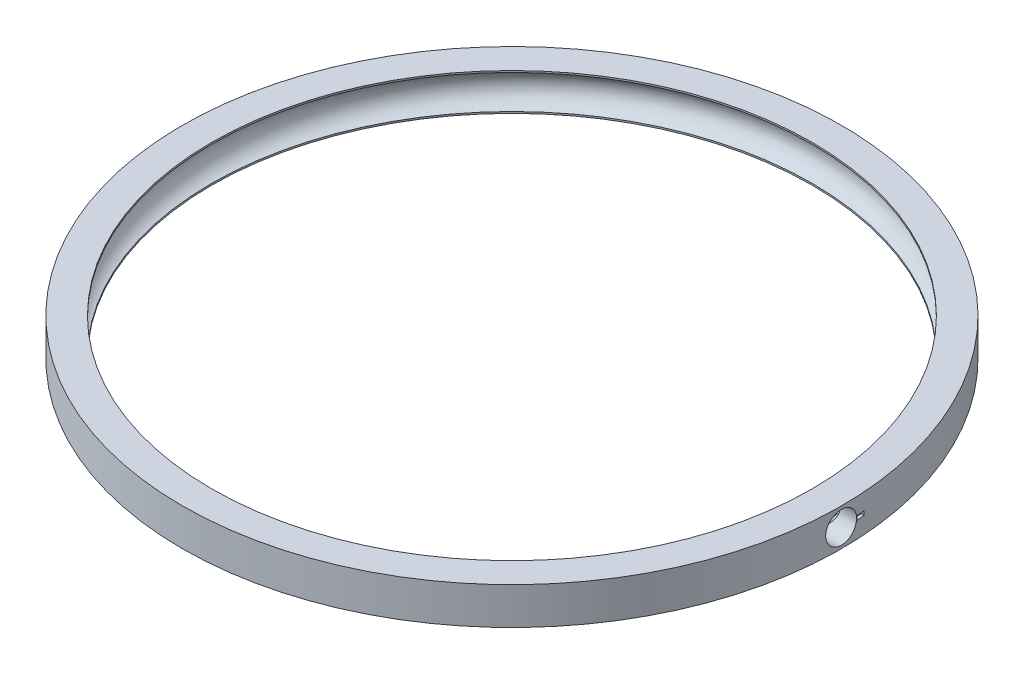
ISO-10303-21;
HEADER;
FILE_DESCRIPTION(('STEP AP214'),'2;1');
FILE_NAME('part.step','',(''),(''),'','','');
FILE_SCHEMA(('AUTOMOTIVE_DESIGN { 1 0 10303 214 1 1 1 1 }'));
ENDSEC;
DATA;
#1=APPLICATION_CONTEXT('core data for automotive mechanical design processes');
#2=APPLICATION_PROTOCOL_DEFINITION('international standard','automotive_design',2000,#1);
#3=PRODUCT_CONTEXT('',#1,'mechanical');
#4=PRODUCT('Part','Part','',(#3));
#5=PRODUCT_RELATED_PRODUCT_CATEGORY('part','',(#4));
#6=PRODUCT_DEFINITION_FORMATION('','',#4);
#7=PRODUCT_DEFINITION_CONTEXT('part definition',#1,'design');
#8=PRODUCT_DEFINITION('design','',#6,#7);
#9=PRODUCT_DEFINITION_SHAPE('','',#8);
#10=(LENGTH_UNIT() NAMED_UNIT(*) SI_UNIT(.MILLI.,.METRE.));
#11=(NAMED_UNIT(*) PLANE_ANGLE_UNIT() SI_UNIT($,.RADIAN.));
#12=(NAMED_UNIT(*) SI_UNIT($,.STERADIAN.) SOLID_ANGLE_UNIT());
#13=UNCERTAINTY_MEASURE_WITH_UNIT(LENGTH_MEASURE(1.E-05),#10,'distance_accuracy_value','');
#14=(GEOMETRIC_REPRESENTATION_CONTEXT(3) GLOBAL_UNCERTAINTY_ASSIGNED_CONTEXT((#13)) GLOBAL_UNIT_ASSIGNED_CONTEXT((#10,
#11,#12)) REPRESENTATION_CONTEXT('',''));
#15=CARTESIAN_POINT('',(0.,0.,0.));
#16=DIRECTION('',(0.,0.,1.));
#17=DIRECTION('',(1.,0.,0.));
#18=AXIS2_PLACEMENT_3D('',#15,#16,#17);
#19=CARTESIAN_POINT('',(0.,6.,0.));
#20=DIRECTION('',(0.,-1.,0.));
#21=DIRECTION('',(0.,0.,-1.));
#22=AXIS2_PLACEMENT_3D('',#19,#20,#21);
#23=CYLINDRICAL_SURFACE('',#22,53.25);
#24=CARTESIAN_POINT('',(53.1912821804476,3.,2.5));
#25=CARTESIAN_POINT('',(53.1912829698775,2.85965695147165,2.49999380240938));
#26=CARTESIAN_POINT('',(53.1918435839713,2.7192141108021,2.48814260989784));
#27=CARTESIAN_POINT('',(53.1940258865793,2.44220199655424,2.44103350101111));
#28=CARTESIAN_POINT('',(53.1956488284623,2.30563749759736,2.40574793528502));
#29=CARTESIAN_POINT('',(53.1997715437541,2.04043500024635,2.31278190264352));
#30=CARTESIAN_POINT('',(53.2022708734499,1.91179302937036,2.25511276689986));
#31=CARTESIAN_POINT('',(53.2078641788042,1.66605052952044,2.11903379835061));
#32=CARTESIAN_POINT('',(53.2109580131653,1.54894726809551,2.04062889220755));
#33=CARTESIAN_POINT('',(53.2173949365109,1.32946473487919,1.86522420122578));
#34=CARTESIAN_POINT('',(53.2207382213017,1.22709721852106,1.76820971293001));
#35=CARTESIAN_POINT('',(53.2272954644807,1.04009210419735,1.5583687766949));
#36=CARTESIAN_POINT('',(53.2305094176098,0.955455226651637,1.44554168657888));
#37=CARTESIAN_POINT('',(53.2364472541386,0.806282987665055,1.20721858145144));
#38=CARTESIAN_POINT('',(53.2391709193957,0.741756564624579,1.0817169657713));
#39=CARTESIAN_POINT('',(53.2438193011028,0.634694333797301,0.821646821133257));
#40=CARTESIAN_POINT('',(53.2457440230727,0.59215837407629,0.687078354826354));
#41=CARTESIAN_POINT('',(53.2485763247946,0.530314963809877,0.412800580034453));
#42=CARTESIAN_POINT('',(53.249484660648,0.510990245366621,0.273095172999285));
#43=CARTESIAN_POINT('',(53.2501843593197,0.496064595457624,-0.00757937786362463));
#44=CARTESIAN_POINT('',(53.2499757301275,0.500463494303498,-0.148548512645075));
#45=CARTESIAN_POINT('',(53.248465648238,0.532845853936708,-0.427631998702988));
#46=CARTESIAN_POINT('',(53.2471650569982,0.560810723409738,-0.565748512455477));
#47=CARTESIAN_POINT('',(53.243618554465,0.639502392945305,-0.83532458305667));
#48=CARTESIAN_POINT('',(53.241372639554,0.690229280113904,-0.966784114428184));
#49=CARTESIAN_POINT('',(53.2361870185766,0.813026260113108,-1.21937444951434));
#50=CARTESIAN_POINT('',(53.2332470369503,0.885104832939708,-1.34050112478671));
#51=CARTESIAN_POINT('',(53.2270044147853,1.04855293395984,-1.56894226584783));
#52=CARTESIAN_POINT('',(53.2237017720058,1.13992258135738,-1.67625664628063));
#53=CARTESIAN_POINT('',(53.2171020427236,1.33946430602431,-1.87413535028933));
#54=CARTESIAN_POINT('',(53.2138049646579,1.44765251217381,-1.96468341051311));
#55=CARTESIAN_POINT('',(53.2075912748127,1.67770359010858,-2.12633387878243));
#56=CARTESIAN_POINT('',(53.2046746631256,1.79956646521785,-2.19743628210119));
#57=CARTESIAN_POINT('',(53.1995510478315,2.05351734003481,-2.31817562025901));
#58=CARTESIAN_POINT('',(53.197344063929,2.18560562354818,-2.36781195905656));
#59=CARTESIAN_POINT('',(53.1938893476512,2.45625343802776,-2.44419938666786));
#60=CARTESIAN_POINT('',(53.1926416089143,2.59481292607105,-2.4709506272537));
#61=CARTESIAN_POINT('',(53.1912472605578,2.87432831752811,-2.50078840437275));
#62=CARTESIAN_POINT('',(53.1910996009608,3.0152818071169,-2.50389750634906));
#63=CARTESIAN_POINT('',(53.1919193213513,3.29570853614563,-2.48642162236385));
#64=CARTESIAN_POINT('',(53.1928866980951,3.43518177989042,-2.46583670532844));
#65=CARTESIAN_POINT('',(53.1958264968783,3.70862557979246,-2.40157582369331));
#66=CARTESIAN_POINT('',(53.1977984699412,3.84259856525887,-2.35791017405858));
#67=CARTESIAN_POINT('',(53.2025248129255,4.10131364296842,-2.24873777501541));
#68=CARTESIAN_POINT('',(53.205279186831,4.22605568820206,-2.18323091438773));
#69=CARTESIAN_POINT('',(53.2112624351273,4.46287175949186,-2.03217762956025));
#70=CARTESIAN_POINT('',(53.2144916679176,4.57493610302215,-1.94661603983421));
#71=CARTESIAN_POINT('',(53.2210593919797,4.78311830517239,-1.7579042518645));
#72=CARTESIAN_POINT('',(53.2243978838722,4.87923607319509,-1.65475395370087));
#73=CARTESIAN_POINT('',(53.2308109002229,5.05287243318342,-1.43369593350017));
#74=CARTESIAN_POINT('',(53.2338852166855,5.13037645444536,-1.31577675963906));
#75=CARTESIAN_POINT('',(53.2394204194205,5.26448566771027,-1.06858624276708));
#76=CARTESIAN_POINT('',(53.2418813081264,5.32109094261439,-0.939314944790341));
#77=CARTESIAN_POINT('',(53.24591130675,5.41177034599211,-0.673144055090986));
#78=CARTESIAN_POINT('',(53.2474807864133,5.44585381719542,-0.536247652080286));
#79=CARTESIAN_POINT('',(53.2495525497427,5.49055270996808,-0.258667814230478));
#80=CARTESIAN_POINT('',(53.2500548384888,5.5011682432485,-0.117984397421378));
#81=CARTESIAN_POINT('',(53.249935634742,5.49862883258551,0.163031244671301));
#82=CARTESIAN_POINT('',(53.2493152234033,5.48549675747124,0.303363677645301));
#83=CARTESIAN_POINT('',(53.2470226021938,5.43588214105248,0.57982924418194));
#84=CARTESIAN_POINT('',(53.2453503903192,5.39939955526189,0.715962369743771));
#85=CARTESIAN_POINT('',(53.2411423417346,5.30412405724981,0.98017018007415));
#86=CARTESIAN_POINT('',(53.2386064966944,5.24533092982477,1.10824478709776));
#87=CARTESIAN_POINT('',(53.2329564703583,5.10710754049403,1.3527061189781));
#88=CARTESIAN_POINT('',(53.2298423073991,5.02767793286634,1.46909321422431));
#89=CARTESIAN_POINT('',(53.2233828360669,4.8503555138064,1.68698926291798));
#90=CARTESIAN_POINT('',(53.2200373325447,4.75244699090667,1.7884854240516));
#91=CARTESIAN_POINT('',(53.2134934595683,4.54095199201577,1.97363141875608));
#92=CARTESIAN_POINT('',(53.2102951265597,4.42736166012291,2.05727685020562));
#93=CARTESIAN_POINT('',(53.2044043634318,4.18764647361483,2.20438157018687));
#94=CARTESIAN_POINT('',(53.2017123920029,4.06151041096933,2.26782259215147));
#95=CARTESIAN_POINT('',(53.1971453654167,3.80045953023155,2.37255110146904));
#96=CARTESIAN_POINT('',(53.1952693441224,3.6655553130447,2.41386480246973));
#97=CARTESIAN_POINT('',(53.1930433778111,3.44150857741161,2.46230848133983));
#98=CARTESIAN_POINT('',(53.1923858334766,3.35381784516065,2.47642480378522));
#99=CARTESIAN_POINT('',(53.1915049853884,3.1774313728646,2.49527251889519));
#100=CARTESIAN_POINT('',(53.1912816813095,3.08873563357261,2.50000391859188));
#101=CARTESIAN_POINT('',(53.1912821804476,3.,2.5));
#102=B_SPLINE_CURVE_WITH_KNOTS('',3,(#24,#25,#26,#27,#28,#29,#30,#31,#32,#33,#34,#35,#36,#37,
#38,#39,#40,#41,#42,#43,#44,#45,#46,#47,#48,#49,#50,#51,#52,#53,#54,#55,#56,#57,#58,#59,#60,#61,
#62,#63,#64,#65,#66,#67,#68,#69,#70,#71,#72,#73,#74,#75,#76,#77,#78,#79,#80,#81,#82,#83,#84,#85,
#86,#87,#88,#89,#90,#91,#92,#93,#94,#95,#96,#97,#98,#99,#100,#101),.UNSPECIFIED.,.T.,.F.,(4,2,2,
2,2,2,2,2,2,2,2,2,2,2,2,2,2,2,2,2,2,2,2,2,2,2,2,2,2,2,2,2,2,2,2,2,2,2,4),(0.,0.420705230594603,
0.84190771967195,1.26289726211072,1.68378687033074,2.10501040404681,2.52625104932752,
2.94767865535333,3.36910334965668,3.7902143323953,4.21132230304909,4.63209837014979,
5.05287604749696,5.4738210646962,5.89476868308789,6.31612250633491,6.73747643200319,
7.15884205652331,7.58020488655951,8.00116549266755,8.42212487420062,8.84289628446606,
9.26366983740524,9.68476261471148,10.1058577842893,10.5272815174392,10.9487035788674,
11.3699507116643,11.7911958392543,12.2120355258745,12.6328760142577,13.0537205620972,
13.4745517687209,13.8957424070014,14.3170367942729,14.7387109946019,15.1598845375559,
15.4258868337016,15.6918889305321),.UNSPECIFIED.);
#103=CARTESIAN_POINT('',(53.1912821804476,3.,2.5));
#104=VERTEX_POINT('',#103);
#105=EDGE_CURVE('E113',#104,#104,#102,.T.);
#106=ORIENTED_EDGE('',*,*,#105,.F.);
#107=EDGE_LOOP('',(#106));
#108=FACE_BOUND('',#107,.T.);
#109=CARTESIAN_POINT('',(0.,0.,0.));
#110=DIRECTION('',(0.,1.,0.));
#111=DIRECTION('',(0.,0.,1.));
#112=AXIS2_PLACEMENT_3D('',#109,#110,#111);
#113=CIRCLE('',#112,53.25);
#114=CARTESIAN_POINT('',(0.,0.,53.25));
#115=VERTEX_POINT('',#114);
#116=EDGE_CURVE('E56',#115,#115,#113,.T.);
#117=ORIENTED_EDGE('',*,*,#116,.T.);
#118=EDGE_LOOP('',(#117));
#119=FACE_BOUND('',#118,.T.);
#120=CARTESIAN_POINT('',(0.,6.,0.));
#121=DIRECTION('',(0.,1.,0.));
#122=DIRECTION('',(0.,0.,1.));
#123=AXIS2_PLACEMENT_3D('',#120,#121,#122);
#124=CIRCLE('',#123,53.25);
#125=CARTESIAN_POINT('',(0.,6.,53.25));
#126=VERTEX_POINT('',#125);
#127=EDGE_CURVE('E12',#126,#126,#124,.T.);
#128=ORIENTED_EDGE('',*,*,#127,.F.);
#129=EDGE_LOOP('',(#128));
#130=FACE_BOUND('',#129,.T.);
#131=DIRECTION('',(0.,-1.,0.));
#132=VECTOR('',#131,1.);
#133=CARTESIAN_POINT('',(53.1885929784824,6.,-2.55657524226003));
#134=LINE('',#133,#132);
#135=CARTESIAN_POINT('',(53.1885929784824,3.32583707335798,-2.55657524226003));
#136=VERTEX_POINT('',#135);
#137=CARTESIAN_POINT('',(53.1885929784824,2.67416292664202,-2.55657524226003));
#138=VERTEX_POINT('',#137);
#139=EDGE_CURVE('E103',#136,#138,#134,.T.);
#140=ORIENTED_EDGE('',*,*,#139,.F.);
#141=CARTESIAN_POINT('',(0.,3.32583707335798,0.));
#142=DIRECTION('',(0.,-1.,0.));
#143=DIRECTION('',(0.,0.,-1.));
#144=AXIS2_PLACEMENT_3D('',#141,#142,#143);
#145=CIRCLE('',#144,53.25);
#146=CARTESIAN_POINT('',(53.1144603615751,3.32583707335798,-3.79691986993031));
#147=VERTEX_POINT('',#146);
#148=EDGE_CURVE('E118',#147,#136,#145,.T.);
#149=ORIENTED_EDGE('',*,*,#148,.F.);
#150=DIRECTION('',(0.,-1.,0.));
#151=VECTOR('',#150,1.);
#152=CARTESIAN_POINT('',(53.1144603615751,6.,-3.79691986993031));
#153=LINE('',#152,#151);
#154=CARTESIAN_POINT('',(53.1144603615751,2.67416292664202,-3.79691986993031));
#155=VERTEX_POINT('',#154);
#156=EDGE_CURVE('E109',#147,#155,#153,.T.);
#157=ORIENTED_EDGE('',*,*,#156,.T.);
#158=CARTESIAN_POINT('',(0.,2.67416292664202,0.));
#159=DIRECTION('',(0.,1.,0.));
#160=DIRECTION('',(0.,0.,1.));
#161=AXIS2_PLACEMENT_3D('',#158,#159,#160);
#162=CIRCLE('',#161,53.25);
#163=EDGE_CURVE('E70',#138,#155,#162,.T.);
#164=ORIENTED_EDGE('',*,*,#163,.F.);
#165=EDGE_LOOP('',(#140,#149,#157,#164));
#166=FACE_BOUND('',#165,.T.);
#167=ADVANCED_FACE('F44',(#108,#119,#130,#166),#23,.T.);
#168=CARTESIAN_POINT('',(0.,3.,0.));
#169=DIRECTION('',(0.,-1.,0.));
#170=DIRECTION('',(0.,0.,-1.));
#171=AXIS2_PLACEMENT_3D('',#168,#169,#170);
#172=TOROIDAL_SURFACE('',#171,47.7,2.85);
#173=CARTESIAN_POINT('',(0.,5.73541587331798,0.));
#174=DIRECTION('',(0.,-1.,0.));
#175=DIRECTION('',(0.,0.,-1.));
#176=AXIS2_PLACEMENT_3D('',#173,#174,#175);
#177=CIRCLE('',#176,48.5);
#178=CARTESIAN_POINT('',(0.,5.73541587331798,-48.5));
#179=VERTEX_POINT('',#178);
#180=EDGE_CURVE('E136',#179,#179,#177,.T.);
#181=ORIENTED_EDGE('',*,*,#180,.F.);
#182=EDGE_LOOP('',(#181));
#183=FACE_BOUND('',#182,.T.);
#184=CARTESIAN_POINT('',(0.,0.264584126682017,0.));
#185=DIRECTION('',(0.,1.,0.));
#186=DIRECTION('',(0.,0.,1.));
#187=AXIS2_PLACEMENT_3D('',#184,#185,#186);
#188=CIRCLE('',#187,48.5);
#189=CARTESIAN_POINT('',(0.,0.264584126682017,48.5));
#190=VERTEX_POINT('',#189);
#191=EDGE_CURVE('E184',#190,#190,#188,.T.);
#192=ORIENTED_EDGE('',*,*,#191,.F.);
#193=EDGE_LOOP('',(#192));
#194=FACE_BOUND('',#193,.T.);
#195=CARTESIAN_POINT('',(49.1001868962163,0.518187765954163,0.301011685720702));
#196=CARTESIAN_POINT('',(49.0856580462412,0.509742178754236,0.231352032553162));
#197=CARTESIAN_POINT('',(49.0756916330807,0.504120277919043,0.160340226816994));
#198=CARTESIAN_POINT('',(49.0667010094243,0.499040766745443,0.017424984644831));
#199=CARTESIAN_POINT('',(49.0676679506117,0.499578171712046,-0.0544776837467438));
#200=CARTESIAN_POINT('',(49.0803031349716,0.50673703107368,-0.196743582340925));
#201=CARTESIAN_POINT('',(49.0919381149038,0.513339574319013,-0.26711090197545));
#202=CARTESIAN_POINT('',(49.1238951038194,0.532054196890531,-0.405107198854242));
#203=CARTESIAN_POINT('',(49.1442331599396,0.544176456384903,-0.472730863798101));
#204=CARTESIAN_POINT('',(49.2090490606284,0.584439982138249,-0.655247638718493));
#205=CARTESIAN_POINT('',(49.2600781088536,0.617736668462584,-0.766619280041765));
#206=CARTESIAN_POINT('',(49.3711137887108,0.697263488036682,-0.980028063497789));
#207=CARTESIAN_POINT('',(49.4311580111778,0.743548516891267,-1.08202309147832));
#208=CARTESIAN_POINT('',(49.537144942815,0.83368288830729,-1.25037818007817));
#209=CARTESIAN_POINT('',(49.5823679118006,0.874632859774426,-1.31876272081363));
#210=CARTESIAN_POINT('',(49.6729633035764,0.962802468273548,-1.45126532320957));
#211=CARTESIAN_POINT('',(49.7183357819258,1.01002477430369,-1.51538155108857));
#212=CARTESIAN_POINT('',(49.8527059527725,1.16097513936254,-1.70099412965012));
#213=CARTESIAN_POINT('',(49.9402318750371,1.27420809205171,-1.81616876810164));
#214=CARTESIAN_POINT('',(50.0827078436775,1.49440313673433,-1.9995629594732));
#215=CARTESIAN_POINT('',(50.1403365859605,1.59587888158488,-2.0723277064584));
#216=CARTESIAN_POINT('',(50.2453889578884,1.81247878047712,-2.2035804000063));
#217=CARTESIAN_POINT('',(50.2928266110104,1.92758383690068,-2.26208798027565));
#218=CARTESIAN_POINT('',(50.3676747306472,2.15058732977143,-2.35386210998365));
#219=CARTESIAN_POINT('',(50.3970603311162,2.25677909895071,-2.38964955724474));
#220=CARTESIAN_POINT('',(50.4442420307624,2.47544097578231,-2.4469540122726));
#221=CARTESIAN_POINT('',(50.4620442278172,2.58790774615804,-2.46847852861653));
#222=CARTESIAN_POINT('',(50.4847544128722,2.81647556793529,-2.49591880627431));
#223=CARTESIAN_POINT('',(50.489614091214,2.93258860329393,-2.50177608792028));
#224=CARTESIAN_POINT('',(50.4858924985373,3.16428223216531,-2.4972854281378));
#225=CARTESIAN_POINT('',(50.4773113596112,3.27986283089947,-2.48693764596791));
#226=CARTESIAN_POINT('',(50.4483373766971,3.49988642992734,-2.45189194191625));
#227=CARTESIAN_POINT('',(50.4286961668054,3.60457893460551,-2.42810689877294));
#228=CARTESIAN_POINT('',(50.3794882347124,3.80788673988453,-2.36823970273732));
#229=CARTESIAN_POINT('',(50.3499200274945,3.90650112862353,-2.33215570998713));
#230=CARTESIAN_POINT('',(50.279663979435,4.10399525266607,-2.24583294256379));
#231=CARTESIAN_POINT('',(50.2382523671427,4.20220579890472,-2.19466193786866));
#232=CARTESIAN_POINT('',(50.1479034496804,4.38854941107473,-2.0817837213908));
#233=CARTESIAN_POINT('',(50.098960240981,4.47667447634321,-2.02006824025609));
#234=CARTESIAN_POINT('',(49.9705113459538,4.68277087060576,-1.85556983811459));
#235=CARTESIAN_POINT('',(49.8877064300143,4.79445257365462,-1.74739835658952));
#236=CARTESIAN_POINT('',(49.7598235087085,4.94454647638478,-1.57310028843295));
#237=CARTESIAN_POINT('',(49.716514131429,4.99173182554906,-1.512892661025));
#238=CARTESIAN_POINT('',(49.629648957117,5.08032995333641,-1.38854023979019));
#239=CARTESIAN_POINT('',(49.586093250076,5.12174471417581,-1.32439680888438));
#240=CARTESIAN_POINT('',(49.4791498056008,5.21731764246864,-1.16034072545009));
#241=CARTESIAN_POINT('',(49.4162924006854,5.26803290338385,-1.05805449049732));
#242=CARTESIAN_POINT('',(49.2981483798989,5.3561106695741,-0.84386463438721));
#243=CARTESIAN_POINT('',(49.2428405034855,5.39351117033609,-0.731989528606341));
#244=CARTESIAN_POINT('',(49.1679377494311,5.44135219159318,-0.543309639355197));
#245=CARTESIAN_POINT('',(49.142845582242,5.45661286713568,-0.469971652073992));
#246=CARTESIAN_POINT('',(49.102415448402,5.4806354056932,-0.319698923523434));
#247=CARTESIAN_POINT('',(49.087050164575,5.48941548058735,-0.242774912432655));
#248=CARTESIAN_POINT('',(49.0688680700184,5.49976072031219,-0.0860426283117167));
#249=CARTESIAN_POINT('',(49.0661852234945,5.50124886669927,-0.00621250113070434));
#250=CARTESIAN_POINT('',(49.0744015687289,5.49660927555411,0.152547840141277));
#251=CARTESIAN_POINT('',(49.0853159414389,5.49047302559624,0.231476948912912));
#252=CARTESIAN_POINT('',(49.1218495231995,5.46919889969703,0.402511724410781));
#253=CARTESIAN_POINT('',(49.1501203131182,5.45241278086366,0.493813109255676));
#254=CARTESIAN_POINT('',(49.2171375014728,5.41014256035825,0.670470346514111));
#255=CARTESIAN_POINT('',(49.2559243775992,5.38462474774766,0.755801588365688));
#256=CARTESIAN_POINT('',(49.3336783030463,5.32988057252863,0.909605726505982));
#257=CARTESIAN_POINT('',(49.3719204328166,5.30161365914086,0.978802967943082));
#258=CARTESIAN_POINT('',(49.4507941263089,5.23963651326977,1.11333633789502));
#259=CARTESIAN_POINT('',(49.4914272751849,5.20592264321452,1.1786698460337));
#260=CARTESIAN_POINT('',(49.5736762384489,5.13317021977231,1.30573614462868));
#261=CARTESIAN_POINT('',(49.6152928803882,5.09412703986523,1.36746573920917));
#262=CARTESIAN_POINT('',(49.6984283189971,5.01074777886777,1.48735522266429));
#263=CARTESIAN_POINT('',(49.739947074408,4.96640977103914,1.54551380035123));
#264=CARTESIAN_POINT('',(49.823975113113,4.87015785359782,1.66084882070844));
#265=CARTESIAN_POINT('',(49.8664356675754,4.81798177774156,1.71784277698187));
#266=CARTESIAN_POINT('',(49.9493841203335,4.70773612221501,1.82747995738498));
#267=CARTESIAN_POINT('',(49.9898711164437,4.6496638839044,1.88012119924598));
#268=CARTESIAN_POINT('',(50.0678665457193,4.52782360955868,1.98039344295051));
#269=CARTESIAN_POINT('',(50.1053832568272,4.46407253708959,2.02803849852078));
#270=CARTESIAN_POINT('',(50.1766781544781,4.33087164180384,2.11783740851344));
#271=CARTESIAN_POINT('',(50.2104566817078,4.26142233931266,2.15999176340354));
#272=CARTESIAN_POINT('',(50.2851445699303,4.09007355910999,2.25264865681655));
#273=CARTESIAN_POINT('',(50.3240086930478,3.98573843782998,2.3003931864829));
#274=CARTESIAN_POINT('',(50.3905931051758,3.76838329790432,2.38181323348765));
#275=CARTESIAN_POINT('',(50.4183210380742,3.65536930013383,2.41549840180544));
#276=CARTESIAN_POINT('',(50.4607421394348,3.42257365040427,2.46692305665045));
#277=CARTESIAN_POINT('',(50.4753542434987,3.3027547114181,2.48456338437142));
#278=CARTESIAN_POINT('',(50.4899557496644,3.06094609160819,2.50219124566608));
#279=CARTESIAN_POINT('',(50.4899507143353,2.93895725421472,2.5021854944753));
#280=CARTESIAN_POINT('',(50.4760579392167,2.70891095642945,2.48541263647753));
#281=CARTESIAN_POINT('',(50.4635115097176,2.60064620589295,2.47026496457943));
#282=CARTESIAN_POINT('',(50.427426078797,2.38879212084294,2.42654676412495));
#283=CARTESIAN_POINT('',(50.4038853958833,2.28520350416918,2.39797418232091));
#284=CARTESIAN_POINT('',(50.3463545462425,2.08158670182778,2.32776794145438));
#285=CARTESIAN_POINT('',(50.3120452041355,1.98178879292888,2.28573440974777));
#286=CARTESIAN_POINT('',(50.2352056782112,1.79098699533482,2.19081250970919));
#287=CARTESIAN_POINT('',(50.1926732079853,1.69998556304587,2.13792112213941));
#288=CARTESIAN_POINT('',(50.0804693742791,1.48810997120186,1.99674090417163));
#289=CARTESIAN_POINT('',(50.0072649866933,1.37252847505228,1.90330696747787));
#290=CARTESIAN_POINT('',(49.8530082529236,1.16166633071105,1.70060689873221));
#291=CARTESIAN_POINT('',(49.7719274826139,1.066463504852,1.59128266069219));
#292=CARTESIAN_POINT('',(49.6484726646475,0.938252256893907,1.41582706391444));
#293=CARTESIAN_POINT('',(49.6065916023972,0.897620507869364,1.35476705538094));
#294=CARTESIAN_POINT('',(49.5234534501034,0.821668284003329,1.22893408049268));
#295=CARTESIAN_POINT('',(49.4821967003235,0.786350617874658,1.16415917546668));
#296=CARTESIAN_POINT('',(49.401841128384,0.721309066637666,1.03103525270434));
#297=CARTESIAN_POINT('',(49.3627335435338,0.691561056672327,0.962703368958573));
#298=CARTESIAN_POINT('',(49.2883553768477,0.637763092535956,0.821893814548055));
#299=CARTESIAN_POINT('',(49.2530796868402,0.613705500971646,0.749421864639829));
#300=CARTESIAN_POINT('',(49.195571317719,0.576092648731858,0.615207575523574));
#301=CARTESIAN_POINT('',(49.1721468758387,0.561395616626332,0.554305833523229));
#302=CARTESIAN_POINT('',(49.1312263407157,0.536379892616386,0.429663195002294));
#303=CARTESIAN_POINT('',(49.1137257057288,0.52605784490171,0.365924516162139));
#304=CARTESIAN_POINT('',(49.1001868962163,0.518187765954163,0.301011685720702));
#305=B_SPLINE_CURVE_WITH_KNOTS('',3,(#195,#196,#197,#198,#199,#200,#201,#202,#203,#204,#205,
#206,#207,#208,#209,#210,#211,#212,#213,#214,#215,#216,#217,#218,#219,#220,#221,#222,#223,#224,
#225,#226,#227,#228,#229,#230,#231,#232,#233,#234,#235,#236,#237,#238,#239,#240,#241,#242,#243,
#244,#245,#246,#247,#248,#249,#250,#251,#252,#253,#254,#255,#256,#257,#258,#259,#260,#261,#262,
#263,#264,#265,#266,#267,#268,#269,#270,#271,#272,#273,#274,#275,#276,#277,#278,#279,#280,#281,
#282,#283,#284,#285,#286,#287,#288,#289,#290,#291,#292,#293,#294,#295,#296,#297,#298,#299,#300,
#301,#302,#303,#304),.UNSPECIFIED.,.T.,.F.,(4,2,2,2,2,2,2,2,2,2,2,2,2,2,2,2,2,2,2,2,2,2,2,2,2,2,
2,2,2,2,2,2,2,2,2,2,2,2,2,2,2,2,2,2,2,2,2,2,2,2,2,2,2,2,4),(0.,0.214772932723609,
0.429372063082116,0.643304334517983,0.857632775503096,1.23633167446593,1.61665590771293,
1.89125980355656,2.16598092519562,2.71380781648225,3.1249284828054,3.53547974942332,
3.88156195384903,4.22746182171221,4.57465100865997,4.92183678355675,5.24786610624139,
5.57394422261164,5.9273258503165,6.2809858952619,6.80639869127018,7.06991330906804,
7.33333718437905,7.72337772789339,8.11229614310832,8.34858739240051,8.58421205766441,
8.82232014000087,9.06069430239923,9.35018941263114,9.64081504477651,9.89237831860647,
10.144110290484,10.3960622044016,10.6481060822433,10.9122996667637,11.1766129124545,
11.4401615178668,11.7036860844521,12.0655849942679,12.4272350701511,12.791105288482,
13.1548370356019,13.4834272120761,13.8120676605255,14.1515524390693,14.4911317461339,
14.9855090430559,15.4817418613735,15.734920652047,15.9882327916557,16.2404209589914,
16.4922687067013,16.6925602640266,16.8926979094405),.UNSPECIFIED.);
#306=CARTESIAN_POINT('',(49.1001868962163,0.518187765954163,0.301011685720702));
#307=VERTEX_POINT('',#306);
#308=EDGE_CURVE('E47',#307,#307,#305,.T.);
#309=ORIENTED_EDGE('',*,*,#308,.T.);
#310=EDGE_LOOP('',(#309));
#311=FACE_BOUND('',#310,.T.);
#312=ADVANCED_FACE('F149',(#183,#194,#311),#172,.F.);
#313=CARTESIAN_POINT('',(0.,6.,0.));
#314=DIRECTION('',(0.,-1.,0.));
#315=DIRECTION('',(0.,0.,-1.));
#316=AXIS2_PLACEMENT_3D('',#313,#314,#315);
#317=CYLINDRICAL_SURFACE('',#316,48.5);
#318=CARTESIAN_POINT('',(0.,0.,0.));
#319=DIRECTION('',(0.,1.,0.));
#320=DIRECTION('',(0.,0.,1.));
#321=AXIS2_PLACEMENT_3D('',#318,#319,#320);
#322=CIRCLE('',#321,48.5);
#323=CARTESIAN_POINT('',(0.,0.,48.5));
#324=VERTEX_POINT('',#323);
#325=EDGE_CURVE('E185',#324,#324,#322,.T.);
#326=ORIENTED_EDGE('',*,*,#325,.F.);
#327=EDGE_LOOP('',(#326));
#328=FACE_BOUND('',#327,.T.);
#329=ORIENTED_EDGE('',*,*,#191,.T.);
#330=EDGE_LOOP('',(#329));
#331=FACE_BOUND('',#330,.T.);
#332=ADVANCED_FACE('F151',(#328,#331),#317,.F.);
#333=CARTESIAN_POINT('',(0.,6.,0.));
#334=DIRECTION('',(0.,1.,0.));
#335=DIRECTION('',(0.,0.,1.));
#336=AXIS2_PLACEMENT_3D('',#333,#334,#335);
#337=CIRCLE('',#336,48.5);
#338=CARTESIAN_POINT('',(0.,6.,48.5));
#339=VERTEX_POINT('',#338);
#340=EDGE_CURVE('E137',#339,#339,#337,.T.);
#341=ORIENTED_EDGE('',*,*,#340,.T.);
#342=EDGE_LOOP('',(#341));
#343=FACE_BOUND('',#342,.T.);
#344=ORIENTED_EDGE('',*,*,#180,.T.);
#345=EDGE_LOOP('',(#344));
#346=FACE_BOUND('',#345,.T.);
#347=ADVANCED_FACE('F157',(#343,#346),#317,.F.);
#348=CARTESIAN_POINT('',(0.,6.,0.));
#349=DIRECTION('',(0.,1.,0.));
#350=DIRECTION('',(0.,0.,1.));
#351=AXIS2_PLACEMENT_3D('',#348,#349,#350);
#352=PLANE('',#351);
#353=ORIENTED_EDGE('',*,*,#127,.T.);
#354=EDGE_LOOP('',(#353));
#355=FACE_BOUND('',#354,.T.);
#356=ORIENTED_EDGE('',*,*,#340,.F.);
#357=EDGE_LOOP('',(#356));
#358=FACE_BOUND('',#357,.T.);
#359=ADVANCED_FACE('F158',(#355,#358),#352,.T.);
#360=CARTESIAN_POINT('',(0.,0.,0.));
#361=DIRECTION('',(0.,1.,0.));
#362=DIRECTION('',(0.,0.,1.));
#363=AXIS2_PLACEMENT_3D('',#360,#361,#362);
#364=PLANE('',#363);
#365=ORIENTED_EDGE('',*,*,#116,.F.);
#366=EDGE_LOOP('',(#365));
#367=FACE_BOUND('',#366,.T.);
#368=ORIENTED_EDGE('',*,*,#325,.T.);
#369=EDGE_LOOP('',(#368));
#370=FACE_BOUND('',#369,.T.);
#371=ADVANCED_FACE('F144',(#367,#370),#364,.F.);
#372=CARTESIAN_POINT('',(120.,3.,0.));
#373=DIRECTION('',(-1.,0.,0.));
#374=DIRECTION('',(0.,0.,1.));
#375=AXIS2_PLACEMENT_3D('',#372,#373,#374);
#376=CYLINDRICAL_SURFACE('',#375,2.5);
#377=ORIENTED_EDGE('',*,*,#308,.F.);
#378=EDGE_LOOP('',(#377));
#379=FACE_BOUND('',#378,.T.);
#380=ORIENTED_EDGE('',*,*,#105,.T.);
#381=EDGE_LOOP('',(#380));
#382=FACE_BOUND('',#381,.T.);
#383=ADVANCED_FACE('F138',(#379,#382),#376,.F.);
#384=CARTESIAN_POINT('',(-0.5,6.,0.));
#385=DIRECTION('',(0.,-1.,0.));
#386=DIRECTION('',(0.,0.,-1.));
#387=AXIS2_PLACEMENT_3D('',#384,#385,#386);
#388=CYLINDRICAL_SURFACE('',#387,53.25);
#389=DIRECTION('',(0.,-1.,0.));
#390=VECTOR('',#389,1.);
#391=CARTESIAN_POINT('',(52.6885929784824,6.,-2.55657524226003));
#392=LINE('',#391,#390);
#393=CARTESIAN_POINT('',(52.6885929784824,3.32583707335798,-2.55657524226003));
#394=VERTEX_POINT('',#393);
#395=CARTESIAN_POINT('',(52.6885929784824,2.67416292664202,-2.55657524226003));
#396=VERTEX_POINT('',#395);
#397=EDGE_CURVE('E123',#394,#396,#392,.T.);
#398=ORIENTED_EDGE('',*,*,#397,.T.);
#399=CARTESIAN_POINT('',(-0.5,2.67416292664202,0.));
#400=DIRECTION('',(0.,1.,0.));
#401=DIRECTION('',(0.,0.,1.));
#402=AXIS2_PLACEMENT_3D('',#399,#400,#401);
#403=CIRCLE('',#402,53.25);
#404=CARTESIAN_POINT('',(52.6144603615751,2.67416292664202,-3.79691986993031));
#405=VERTEX_POINT('',#404);
#406=EDGE_CURVE('E99',#396,#405,#403,.T.);
#407=ORIENTED_EDGE('',*,*,#406,.T.);
#408=DIRECTION('',(0.,-1.,0.));
#409=VECTOR('',#408,1.);
#410=CARTESIAN_POINT('',(52.6144603615751,6.,-3.79691986993031));
#411=LINE('',#410,#409);
#412=CARTESIAN_POINT('',(52.6144603615751,3.32583707335798,-3.79691986993031));
#413=VERTEX_POINT('',#412);
#414=EDGE_CURVE('E117',#413,#405,#411,.T.);
#415=ORIENTED_EDGE('',*,*,#414,.F.);
#416=CARTESIAN_POINT('',(-0.5,3.32583707335798,0.));
#417=DIRECTION('',(0.,-1.,0.));
#418=DIRECTION('',(0.,0.,-1.));
#419=AXIS2_PLACEMENT_3D('',#416,#417,#418);
#420=CIRCLE('',#419,53.25);
#421=EDGE_CURVE('E95',#413,#394,#420,.T.);
#422=ORIENTED_EDGE('',*,*,#421,.T.);
#423=EDGE_LOOP('',(#398,#407,#415,#422));
#424=FACE_BOUND('',#423,.T.);
#425=ADVANCED_FACE('F141',(#424),#388,.T.);
#426=CARTESIAN_POINT('',(53.1885929784824,6.,-2.55657524226003));
#427=DIRECTION('',(0.,0.,-1.));
#428=DIRECTION('',(-1.,0.,0.));
#429=AXIS2_PLACEMENT_3D('',#426,#427,#428);
#430=PLANE('',#429);
#431=ORIENTED_EDGE('',*,*,#397,.F.);
#432=DIRECTION('',(-1.,0.,0.));
#433=VECTOR('',#432,1.);
#434=CARTESIAN_POINT('',(53.1885929784824,3.32583707335798,-2.55657524226003));
#435=LINE('',#434,#433);
#436=EDGE_CURVE('E77',#136,#394,#435,.T.);
#437=ORIENTED_EDGE('',*,*,#436,.F.);
#438=ORIENTED_EDGE('',*,*,#139,.T.);
#439=DIRECTION('',(-1.,0.,0.));
#440=VECTOR('',#439,1.);
#441=CARTESIAN_POINT('',(53.1885929784824,2.67416292664202,-2.55657524226003));
#442=LINE('',#441,#440);
#443=EDGE_CURVE('E96',#138,#396,#442,.T.);
#444=ORIENTED_EDGE('',*,*,#443,.T.);
#445=EDGE_LOOP('',(#431,#437,#438,#444));
#446=FACE_BOUND('',#445,.T.);
#447=ADVANCED_FACE('F104',(#446),#430,.T.);
#448=CARTESIAN_POINT('',(53.1885929784824,3.32583707335798,-2.55657524226003));
#449=DIRECTION('',(0.,-1.,0.));
#450=DIRECTION('',(0.,0.,-1.));
#451=AXIS2_PLACEMENT_3D('',#448,#449,#450);
#452=PLANE('',#451);
#453=ORIENTED_EDGE('',*,*,#421,.F.);
#454=DIRECTION('',(-1.,0.,0.));
#455=VECTOR('',#454,1.);
#456=CARTESIAN_POINT('',(53.1144603615751,3.32583707335798,-3.79691986993031));
#457=LINE('',#456,#455);
#458=EDGE_CURVE('E119',#147,#413,#457,.T.);
#459=ORIENTED_EDGE('',*,*,#458,.F.);
#460=ORIENTED_EDGE('',*,*,#148,.T.);
#461=ORIENTED_EDGE('',*,*,#436,.T.);
#462=EDGE_LOOP('',(#453,#459,#460,#461));
#463=FACE_BOUND('',#462,.T.);
#464=ADVANCED_FACE('F232',(#463),#452,.T.);
#465=CARTESIAN_POINT('',(53.1144603615751,2.67416292664202,-3.79691986993031));
#466=DIRECTION('',(0.,1.,0.));
#467=DIRECTION('',(0.,0.,1.));
#468=AXIS2_PLACEMENT_3D('',#465,#466,#467);
#469=PLANE('',#468);
#470=ORIENTED_EDGE('',*,*,#406,.F.);
#471=ORIENTED_EDGE('',*,*,#443,.F.);
#472=ORIENTED_EDGE('',*,*,#163,.T.);
#473=DIRECTION('',(-1.,0.,0.));
#474=VECTOR('',#473,1.);
#475=CARTESIAN_POINT('',(53.1144603615751,2.67416292664202,-3.79691986993031));
#476=LINE('',#475,#474);
#477=EDGE_CURVE('E112',#155,#405,#476,.T.);
#478=ORIENTED_EDGE('',*,*,#477,.T.);
#479=EDGE_LOOP('',(#470,#471,#472,#478));
#480=FACE_BOUND('',#479,.T.);
#481=ADVANCED_FACE('F100',(#480),#469,.T.);
#482=CARTESIAN_POINT('',(53.1144603615751,6.,-3.79691986993031));
#483=DIRECTION('',(0.,0.,-1.));
#484=DIRECTION('',(-1.,0.,0.));
#485=AXIS2_PLACEMENT_3D('',#482,#483,#484);
#486=PLANE('',#485);
#487=ORIENTED_EDGE('',*,*,#414,.T.);
#488=ORIENTED_EDGE('',*,*,#477,.F.);
#489=ORIENTED_EDGE('',*,*,#156,.F.);
#490=ORIENTED_EDGE('',*,*,#458,.T.);
#491=EDGE_LOOP('',(#487,#488,#489,#490));
#492=FACE_BOUND('',#491,.T.);
#493=ADVANCED_FACE('F147',(#492),#486,.F.);
#494=CLOSED_SHELL('',(#167,#312,#332,#347,#359,#371,#383,#425,#447,#464,#481,#493));
#495=MANIFOLD_SOLID_BREP('B2',#494);
#496=ADVANCED_BREP_SHAPE_REPRESENTATION('',(#18,#495),#14);
#497=SHAPE_DEFINITION_REPRESENTATION(#9,#496);
ENDSEC;
END-ISO-10303-21;
